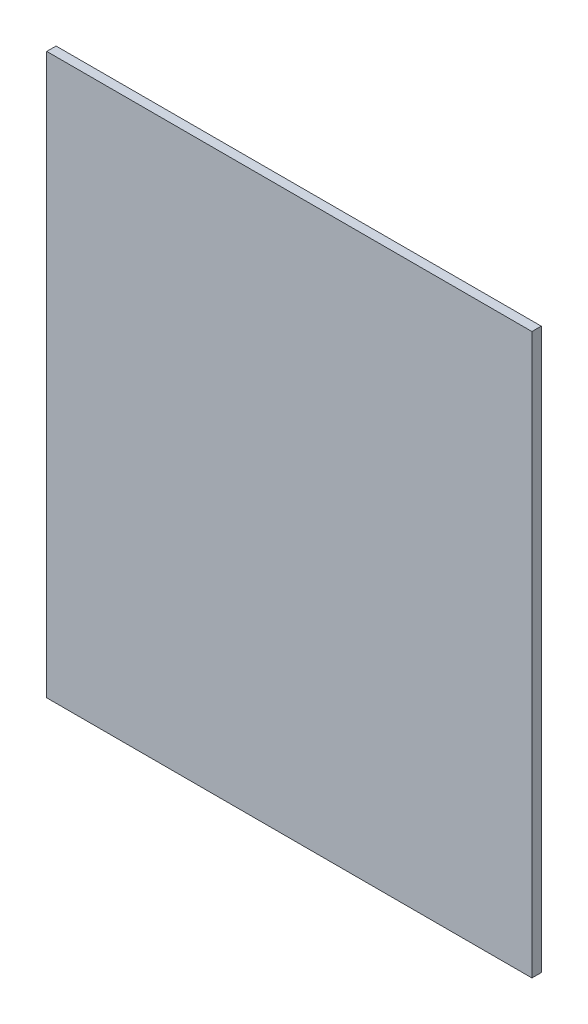
ISO-10303-21;
HEADER;
FILE_DESCRIPTION(('STEP AP214'),'2;1');
FILE_NAME('part.step','',(''),(''),'','','');
FILE_SCHEMA(('AUTOMOTIVE_DESIGN { 1 0 10303 214 1 1 1 1 }'));
ENDSEC;
DATA;
#1=APPLICATION_CONTEXT('core data for automotive mechanical design processes');
#2=APPLICATION_PROTOCOL_DEFINITION('international standard','automotive_design',2000,#1);
#3=PRODUCT_CONTEXT('',#1,'mechanical');
#4=PRODUCT('Part','Part','',(#3));
#5=PRODUCT_RELATED_PRODUCT_CATEGORY('part','',(#4));
#6=PRODUCT_DEFINITION_FORMATION('','',#4);
#7=PRODUCT_DEFINITION_CONTEXT('part definition',#1,'design');
#8=PRODUCT_DEFINITION('design','',#6,#7);
#9=PRODUCT_DEFINITION_SHAPE('','',#8);
#10=(LENGTH_UNIT() NAMED_UNIT(*) SI_UNIT(.MILLI.,.METRE.));
#11=(NAMED_UNIT(*) PLANE_ANGLE_UNIT() SI_UNIT($,.RADIAN.));
#12=(NAMED_UNIT(*) SI_UNIT($,.STERADIAN.) SOLID_ANGLE_UNIT());
#13=UNCERTAINTY_MEASURE_WITH_UNIT(LENGTH_MEASURE(1.E-05),#10,'distance_accuracy_value','');
#14=(GEOMETRIC_REPRESENTATION_CONTEXT(3) GLOBAL_UNCERTAINTY_ASSIGNED_CONTEXT((#13)) GLOBAL_UNIT_ASSIGNED_CONTEXT((#10,
#11,#12)) REPRESENTATION_CONTEXT('',''));
#15=CARTESIAN_POINT('',(0.,0.,0.));
#16=DIRECTION('',(0.,0.,1.));
#17=DIRECTION('',(1.,0.,0.));
#18=AXIS2_PLACEMENT_3D('',#15,#16,#17);
#19=CARTESIAN_POINT('',(165.1,-190.5,3.175));
#20=DIRECTION('',(-1.,0.,0.));
#21=DIRECTION('',(0.,0.,1.));
#22=AXIS2_PLACEMENT_3D('',#19,#20,#21);
#23=PLANE('',#22);
#24=DIRECTION('',(0.,1.,0.));
#25=VECTOR('',#24,1.);
#26=CARTESIAN_POINT('',(165.1,-190.5,-3.175));
#27=LINE('',#26,#25);
#28=CARTESIAN_POINT('',(165.1,-190.5,-3.175));
#29=VERTEX_POINT('',#28);
#30=CARTESIAN_POINT('',(165.1,190.5,-3.175));
#31=VERTEX_POINT('',#30);
#32=EDGE_CURVE('E107',#29,#31,#27,.T.);
#33=ORIENTED_EDGE('',*,*,#32,.T.);
#34=DIRECTION('',(0.,0.,-1.));
#35=VECTOR('',#34,1.);
#36=CARTESIAN_POINT('',(165.1,190.5,3.175));
#37=LINE('',#36,#35);
#38=CARTESIAN_POINT('',(165.1,190.5,3.175));
#39=VERTEX_POINT('',#38);
#40=EDGE_CURVE('E11',#39,#31,#37,.T.);
#41=ORIENTED_EDGE('',*,*,#40,.F.);
#42=DIRECTION('',(0.,1.,0.));
#43=VECTOR('',#42,1.);
#44=CARTESIAN_POINT('',(165.1,-190.5,3.175));
#45=LINE('',#44,#43);
#46=CARTESIAN_POINT('',(165.1,-190.5,3.175));
#47=VERTEX_POINT('',#46);
#48=EDGE_CURVE('E93',#47,#39,#45,.T.);
#49=ORIENTED_EDGE('',*,*,#48,.F.);
#50=DIRECTION('',(0.,0.,-1.));
#51=VECTOR('',#50,1.);
#52=CARTESIAN_POINT('',(165.1,-190.5,3.175));
#53=LINE('',#52,#51);
#54=EDGE_CURVE('E103',#47,#29,#53,.T.);
#55=ORIENTED_EDGE('',*,*,#54,.T.);
#56=EDGE_LOOP('',(#33,#41,#49,#55));
#57=FACE_BOUND('',#56,.T.);
#58=ADVANCED_FACE('F41',(#57),#23,.F.);
#59=CARTESIAN_POINT('',(-165.1,190.5,3.175));
#60=DIRECTION('',(0.,-1.,0.));
#61=DIRECTION('',(0.,0.,-1.));
#62=AXIS2_PLACEMENT_3D('',#59,#60,#61);
#63=PLANE('',#62);
#64=DIRECTION('',(-1.,0.,0.));
#65=VECTOR('',#64,1.);
#66=CARTESIAN_POINT('',(-165.1,190.5,-3.175));
#67=LINE('',#66,#65);
#68=CARTESIAN_POINT('',(-165.1,190.5,-3.175));
#69=VERTEX_POINT('',#68);
#70=EDGE_CURVE('E98',#31,#69,#67,.T.);
#71=ORIENTED_EDGE('',*,*,#70,.T.);
#72=DIRECTION('',(0.,0.,-1.));
#73=VECTOR('',#72,1.);
#74=CARTESIAN_POINT('',(-165.1,190.5,3.175));
#75=LINE('',#74,#73);
#76=CARTESIAN_POINT('',(-165.1,190.5,3.175));
#77=VERTEX_POINT('',#76);
#78=EDGE_CURVE('E49',#77,#69,#75,.T.);
#79=ORIENTED_EDGE('',*,*,#78,.F.);
#80=DIRECTION('',(-1.,0.,0.));
#81=VECTOR('',#80,1.);
#82=CARTESIAN_POINT('',(-165.1,190.5,3.175));
#83=LINE('',#82,#81);
#84=EDGE_CURVE('E88',#39,#77,#83,.T.);
#85=ORIENTED_EDGE('',*,*,#84,.F.);
#86=ORIENTED_EDGE('',*,*,#40,.T.);
#87=EDGE_LOOP('',(#71,#79,#85,#86));
#88=FACE_BOUND('',#87,.T.);
#89=ADVANCED_FACE('F97',(#88),#63,.F.);
#90=CARTESIAN_POINT('',(-165.1,-190.5,3.175));
#91=DIRECTION('',(1.,0.,0.));
#92=DIRECTION('',(0.,0.,-1.));
#93=AXIS2_PLACEMENT_3D('',#90,#91,#92);
#94=PLANE('',#93);
#95=DIRECTION('',(0.,-1.,0.));
#96=VECTOR('',#95,1.);
#97=CARTESIAN_POINT('',(-165.1,-190.5,-3.175));
#98=LINE('',#97,#96);
#99=CARTESIAN_POINT('',(-165.1,-190.5,-3.175));
#100=VERTEX_POINT('',#99);
#101=EDGE_CURVE('E75',#69,#100,#98,.T.);
#102=ORIENTED_EDGE('',*,*,#101,.T.);
#103=DIRECTION('',(0.,0.,-1.));
#104=VECTOR('',#103,1.);
#105=CARTESIAN_POINT('',(-165.1,-190.5,3.175));
#106=LINE('',#105,#104);
#107=CARTESIAN_POINT('',(-165.1,-190.5,3.175));
#108=VERTEX_POINT('',#107);
#109=EDGE_CURVE('E99',#108,#100,#106,.T.);
#110=ORIENTED_EDGE('',*,*,#109,.F.);
#111=DIRECTION('',(0.,-1.,0.));
#112=VECTOR('',#111,1.);
#113=CARTESIAN_POINT('',(-165.1,-190.5,3.175));
#114=LINE('',#113,#112);
#115=EDGE_CURVE('E91',#77,#108,#114,.T.);
#116=ORIENTED_EDGE('',*,*,#115,.F.);
#117=ORIENTED_EDGE('',*,*,#78,.T.);
#118=EDGE_LOOP('',(#102,#110,#116,#117));
#119=FACE_BOUND('',#118,.T.);
#120=ADVANCED_FACE('F100',(#119),#94,.F.);
#121=CARTESIAN_POINT('',(-165.1,-190.5,3.175));
#122=DIRECTION('',(0.,1.,0.));
#123=DIRECTION('',(0.,0.,1.));
#124=AXIS2_PLACEMENT_3D('',#121,#122,#123);
#125=PLANE('',#124);
#126=DIRECTION('',(1.,0.,0.));
#127=VECTOR('',#126,1.);
#128=CARTESIAN_POINT('',(-165.1,-190.5,-3.175));
#129=LINE('',#128,#127);
#130=EDGE_CURVE('E81',#100,#29,#129,.T.);
#131=ORIENTED_EDGE('',*,*,#130,.T.);
#132=ORIENTED_EDGE('',*,*,#54,.F.);
#133=DIRECTION('',(1.,0.,0.));
#134=VECTOR('',#133,1.);
#135=CARTESIAN_POINT('',(-165.1,-190.5,3.175));
#136=LINE('',#135,#134);
#137=EDGE_CURVE('E58',#108,#47,#136,.T.);
#138=ORIENTED_EDGE('',*,*,#137,.F.);
#139=ORIENTED_EDGE('',*,*,#109,.T.);
#140=EDGE_LOOP('',(#131,#132,#138,#139));
#141=FACE_BOUND('',#140,.T.);
#142=ADVANCED_FACE('F118',(#141),#125,.F.);
#143=CARTESIAN_POINT('',(0.,0.,3.175));
#144=DIRECTION('',(0.,0.,-1.));
#145=DIRECTION('',(-1.,0.,0.));
#146=AXIS2_PLACEMENT_3D('',#143,#144,#145);
#147=PLANE('',#146);
#148=ORIENTED_EDGE('',*,*,#48,.T.);
#149=ORIENTED_EDGE('',*,*,#84,.T.);
#150=ORIENTED_EDGE('',*,*,#115,.T.);
#151=ORIENTED_EDGE('',*,*,#137,.T.);
#152=EDGE_LOOP('',(#148,#149,#150,#151));
#153=FACE_BOUND('',#152,.T.);
#154=ADVANCED_FACE('F89',(#153),#147,.F.);
#155=CARTESIAN_POINT('',(0.,0.,-3.175));
#156=DIRECTION('',(0.,0.,-1.));
#157=DIRECTION('',(-1.,0.,0.));
#158=AXIS2_PLACEMENT_3D('',#155,#156,#157);
#159=PLANE('',#158);
#160=ORIENTED_EDGE('',*,*,#32,.F.);
#161=ORIENTED_EDGE('',*,*,#130,.F.);
#162=ORIENTED_EDGE('',*,*,#101,.F.);
#163=ORIENTED_EDGE('',*,*,#70,.F.);
#164=EDGE_LOOP('',(#160,#161,#162,#163));
#165=FACE_BOUND('',#164,.T.);
#166=ADVANCED_FACE('F121',(#165),#159,.T.);
#167=CLOSED_SHELL('',(#58,#89,#120,#142,#154,#166));
#168=MANIFOLD_SOLID_BREP('B2',#167);
#169=ADVANCED_BREP_SHAPE_REPRESENTATION('',(#18,#168),#14);
#170=SHAPE_DEFINITION_REPRESENTATION(#9,#169);
ENDSEC;
END-ISO-10303-21;
